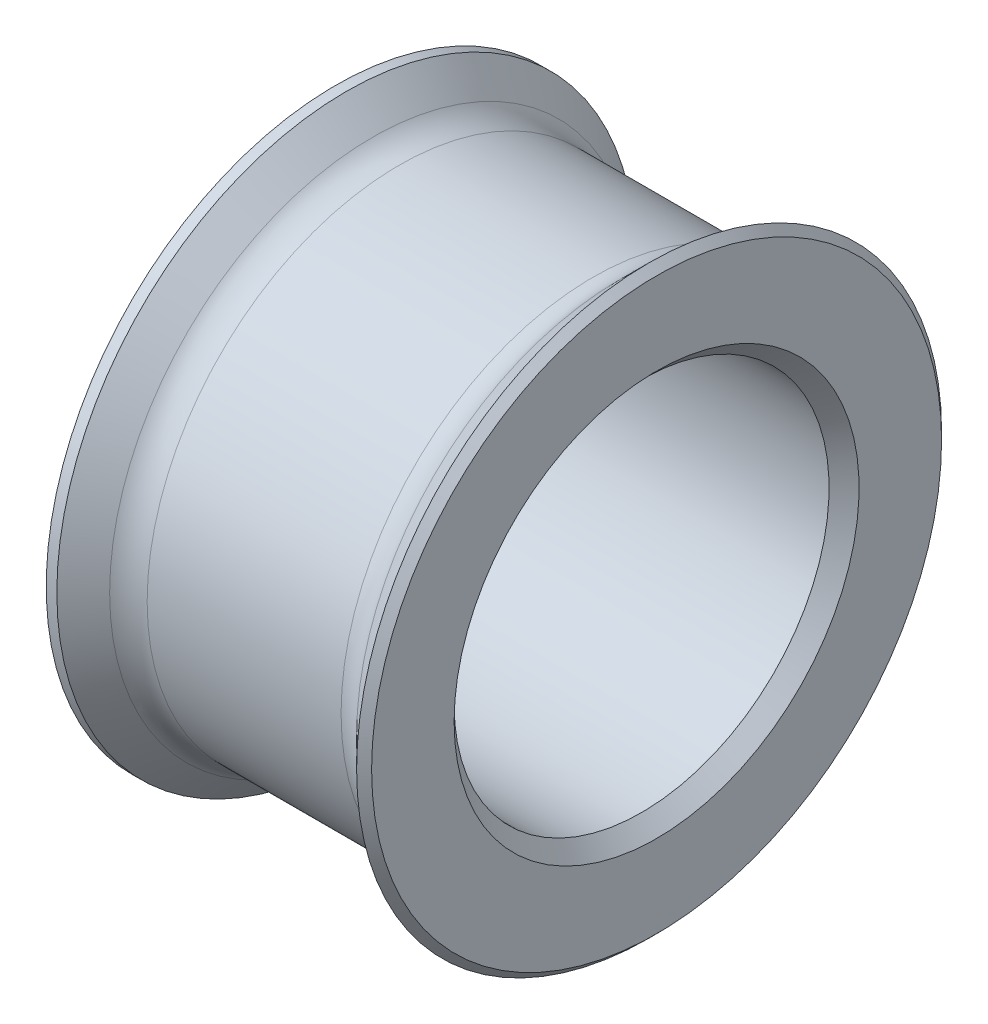
ISO-10303-21;
HEADER;
FILE_DESCRIPTION(('STEP AP214'),'2;1');
FILE_NAME('part.step','',(''),(''),'','','');
FILE_SCHEMA(('AUTOMOTIVE_DESIGN { 1 0 10303 214 1 1 1 1 }'));
ENDSEC;
DATA;
#1=APPLICATION_CONTEXT('core data for automotive mechanical design processes');
#2=APPLICATION_PROTOCOL_DEFINITION('international standard','automotive_design',2000,#1);
#3=PRODUCT_CONTEXT('',#1,'mechanical');
#4=PRODUCT('Part','Part','',(#3));
#5=PRODUCT_RELATED_PRODUCT_CATEGORY('part','',(#4));
#6=PRODUCT_DEFINITION_FORMATION('','',#4);
#7=PRODUCT_DEFINITION_CONTEXT('part definition',#1,'design');
#8=PRODUCT_DEFINITION('design','',#6,#7);
#9=PRODUCT_DEFINITION_SHAPE('','',#8);
#10=(LENGTH_UNIT() NAMED_UNIT(*) SI_UNIT(.MILLI.,.METRE.));
#11=(NAMED_UNIT(*) PLANE_ANGLE_UNIT() SI_UNIT($,.RADIAN.));
#12=(NAMED_UNIT(*) SI_UNIT($,.STERADIAN.) SOLID_ANGLE_UNIT());
#13=UNCERTAINTY_MEASURE_WITH_UNIT(LENGTH_MEASURE(1.E-05),#10,'distance_accuracy_value','');
#14=(GEOMETRIC_REPRESENTATION_CONTEXT(3) GLOBAL_UNCERTAINTY_ASSIGNED_CONTEXT((#13)) GLOBAL_UNIT_ASSIGNED_CONTEXT((#10,
#11,#12)) REPRESENTATION_CONTEXT('',''));
#15=CARTESIAN_POINT('',(0.,0.,0.));
#16=DIRECTION('',(0.,0.,1.));
#17=DIRECTION('',(1.,0.,0.));
#18=AXIS2_PLACEMENT_3D('',#15,#16,#17);
#19=CARTESIAN_POINT('',(0.,0.,0.));
#20=DIRECTION('',(-1.,0.,0.));
#21=DIRECTION('',(0.,0.,1.));
#22=AXIS2_PLACEMENT_3D('',#19,#20,#21);
#23=CYLINDRICAL_SURFACE('',#22,3.36);
#24=CARTESIAN_POINT('',(1.29289321881345,0.,0.));
#25=DIRECTION('',(-1.,0.,0.));
#26=DIRECTION('',(0.,0.,1.));
#27=AXIS2_PLACEMENT_3D('',#24,#25,#26);
#28=CIRCLE('',#27,3.36);
#29=CARTESIAN_POINT('',(1.29289321881345,0.,3.36));
#30=VERTEX_POINT('',#29);
#31=EDGE_CURVE('E44',#30,#30,#28,.T.);
#32=ORIENTED_EDGE('',*,*,#31,.T.);
#33=EDGE_LOOP('',(#32));
#34=FACE_BOUND('',#33,.T.);
#35=CARTESIAN_POINT('',(-1.29289321881345,0.,0.));
#36=DIRECTION('',(-1.,0.,0.));
#37=DIRECTION('',(0.,0.,1.));
#38=AXIS2_PLACEMENT_3D('',#35,#36,#37);
#39=CIRCLE('',#38,3.36);
#40=CARTESIAN_POINT('',(-1.29289321881345,0.,3.36));
#41=VERTEX_POINT('',#40);
#42=EDGE_CURVE('E48',#41,#41,#39,.F.);
#43=ORIENTED_EDGE('',*,*,#42,.T.);
#44=EDGE_LOOP('',(#43));
#45=FACE_BOUND('',#44,.T.);
#46=ADVANCED_FACE('F33',(#34,#45),#23,.T.);
#47=CARTESIAN_POINT('',(2.14,0.,0.));
#48=DIRECTION('',(1.,0.,0.));
#49=DIRECTION('',(0.,0.,-1.));
#50=AXIS2_PLACEMENT_3D('',#47,#48,#49);
#51=CONICAL_SURFACE('',#50,4.,0.78539816339745);
#52=CARTESIAN_POINT('',(1.64644660940673,0.,0.));
#53=DIRECTION('',(1.,0.,0.));
#54=DIRECTION('',(0.,0.,-1.));
#55=AXIS2_PLACEMENT_3D('',#52,#53,#54);
#56=CIRCLE('',#55,3.50644660940673);
#57=CARTESIAN_POINT('',(1.64644660940673,0.,-3.50644660940673));
#58=VERTEX_POINT('',#57);
#59=EDGE_CURVE('E40',#58,#58,#56,.T.);
#60=ORIENTED_EDGE('',*,*,#59,.T.);
#61=EDGE_LOOP('',(#60));
#62=FACE_BOUND('',#61,.T.);
#63=CARTESIAN_POINT('',(2.03999999999999,0.,0.));
#64=DIRECTION('',(-1.,0.,0.));
#65=DIRECTION('',(0.,0.,1.));
#66=AXIS2_PLACEMENT_3D('',#63,#64,#65);
#67=CIRCLE('',#66,3.9);
#68=CARTESIAN_POINT('',(2.03999999999999,0.,3.9));
#69=VERTEX_POINT('',#68);
#70=EDGE_CURVE('E53',#69,#69,#67,.T.);
#71=ORIENTED_EDGE('',*,*,#70,.T.);
#72=EDGE_LOOP('',(#71));
#73=FACE_BOUND('',#72,.T.);
#74=ADVANCED_FACE('F103',(#62,#73),#51,.T.);
#75=CARTESIAN_POINT('',(2.14,4.,0.));
#76=DIRECTION('',(-1.,0.,0.));
#77=DIRECTION('',(0.,0.,1.));
#78=AXIS2_PLACEMENT_3D('',#75,#76,#77);
#79=PLANE('',#78);
#80=CARTESIAN_POINT('',(2.14,0.,0.));
#81=DIRECTION('',(-1.,0.,0.));
#82=DIRECTION('',(0.,0.,1.));
#83=AXIS2_PLACEMENT_3D('',#80,#81,#82);
#84=CIRCLE('',#83,2.7);
#85=CARTESIAN_POINT('',(2.14,0.,2.7));
#86=VERTEX_POINT('',#85);
#87=EDGE_CURVE('E56',#86,#86,#84,.T.);
#88=ORIENTED_EDGE('',*,*,#87,.T.);
#89=EDGE_LOOP('',(#88));
#90=FACE_BOUND('',#89,.T.);
#91=CARTESIAN_POINT('',(2.14,0.,0.));
#92=DIRECTION('',(-1.,0.,0.));
#93=DIRECTION('',(0.,0.,1.));
#94=AXIS2_PLACEMENT_3D('',#91,#92,#93);
#95=CIRCLE('',#94,3.8);
#96=CARTESIAN_POINT('',(2.14,0.,3.8));
#97=VERTEX_POINT('',#96);
#98=EDGE_CURVE('E59',#97,#97,#95,.F.);
#99=ORIENTED_EDGE('',*,*,#98,.T.);
#100=EDGE_LOOP('',(#99));
#101=FACE_BOUND('',#100,.T.);
#102=ADVANCED_FACE('F91',(#90,#101),#79,.F.);
#103=CARTESIAN_POINT('',(0.,0.,0.));
#104=DIRECTION('',(-1.,0.,0.));
#105=DIRECTION('',(0.,0.,1.));
#106=AXIS2_PLACEMENT_3D('',#103,#104,#105);
#107=CYLINDRICAL_SURFACE('',#106,2.5);
#108=CARTESIAN_POINT('',(-1.93999999999999,0.,0.));
#109=DIRECTION('',(1.,0.,0.));
#110=DIRECTION('',(0.,0.,-1.));
#111=AXIS2_PLACEMENT_3D('',#108,#109,#110);
#112=CIRCLE('',#111,2.5);
#113=CARTESIAN_POINT('',(-1.93999999999999,0.,2.5));
#114=VERTEX_POINT('',#113);
#115=EDGE_CURVE('E62',#114,#114,#112,.F.);
#116=ORIENTED_EDGE('',*,*,#115,.T.);
#117=EDGE_LOOP('',(#116));
#118=FACE_BOUND('',#117,.T.);
#119=CARTESIAN_POINT('',(1.94,0.,0.));
#120=DIRECTION('',(-1.,0.,0.));
#121=DIRECTION('',(0.,0.,1.));
#122=AXIS2_PLACEMENT_3D('',#119,#120,#121);
#123=CIRCLE('',#122,2.5);
#124=CARTESIAN_POINT('',(1.94,0.,2.5));
#125=VERTEX_POINT('',#124);
#126=EDGE_CURVE('E65',#125,#125,#123,.F.);
#127=ORIENTED_EDGE('',*,*,#126,.T.);
#128=EDGE_LOOP('',(#127));
#129=FACE_BOUND('',#128,.T.);
#130=ADVANCED_FACE('F88',(#118,#129),#107,.F.);
#131=CARTESIAN_POINT('',(-2.14,2.5,0.));
#132=DIRECTION('',(1.,0.,0.));
#133=DIRECTION('',(0.,0.,-1.));
#134=AXIS2_PLACEMENT_3D('',#131,#132,#133);
#135=PLANE('',#134);
#136=CARTESIAN_POINT('',(-2.14,0.,0.));
#137=DIRECTION('',(1.,0.,0.));
#138=DIRECTION('',(0.,0.,-1.));
#139=AXIS2_PLACEMENT_3D('',#136,#137,#138);
#140=CIRCLE('',#139,3.85857864376269);
#141=CARTESIAN_POINT('',(-2.14,0.,-3.85857864376269));
#142=VERTEX_POINT('',#141);
#143=EDGE_CURVE('E71',#142,#142,#140,.F.);
#144=ORIENTED_EDGE('',*,*,#143,.T.);
#145=EDGE_LOOP('',(#144));
#146=FACE_BOUND('',#145,.T.);
#147=CARTESIAN_POINT('',(-2.14,0.,0.));
#148=DIRECTION('',(1.,0.,0.));
#149=DIRECTION('',(0.,0.,-1.));
#150=AXIS2_PLACEMENT_3D('',#147,#148,#149);
#151=CIRCLE('',#150,2.70000000000001);
#152=CARTESIAN_POINT('',(-2.14,0.,2.70000000000001));
#153=VERTEX_POINT('',#152);
#154=EDGE_CURVE('E74',#153,#153,#151,.T.);
#155=ORIENTED_EDGE('',*,*,#154,.T.);
#156=EDGE_LOOP('',(#155));
#157=FACE_BOUND('',#156,.T.);
#158=ADVANCED_FACE('F78',(#146,#157),#135,.F.);
#159=CARTESIAN_POINT('',(-1.5,0.,0.));
#160=DIRECTION('',(-1.,0.,0.));
#161=DIRECTION('',(0.,0.,1.));
#162=AXIS2_PLACEMENT_3D('',#159,#160,#161);
#163=CONICAL_SURFACE('',#162,3.36,0.78539816339745);
#164=CARTESIAN_POINT('',(-1.64644660940673,0.,0.));
#165=DIRECTION('',(-1.,0.,0.));
#166=DIRECTION('',(0.,0.,1.));
#167=AXIS2_PLACEMENT_3D('',#164,#165,#166);
#168=CIRCLE('',#167,3.50644660940673);
#169=CARTESIAN_POINT('',(-1.64644660940673,0.,3.50644660940673));
#170=VERTEX_POINT('',#169);
#171=EDGE_CURVE('E10',#170,#170,#168,.T.);
#172=ORIENTED_EDGE('',*,*,#171,.T.);
#173=EDGE_LOOP('',(#172));
#174=FACE_BOUND('',#173,.T.);
#175=CARTESIAN_POINT('',(-1.99857864376269,0.,0.));
#176=DIRECTION('',(1.,0.,0.));
#177=DIRECTION('',(0.,0.,-1.));
#178=AXIS2_PLACEMENT_3D('',#175,#176,#177);
#179=CIRCLE('',#178,3.85857864376269);
#180=CARTESIAN_POINT('',(-1.99857864376269,0.,-3.85857864376269));
#181=VERTEX_POINT('',#180);
#182=EDGE_CURVE('E68',#181,#181,#179,.T.);
#183=ORIENTED_EDGE('',*,*,#182,.T.);
#184=EDGE_LOOP('',(#183));
#185=FACE_BOUND('',#184,.T.);
#186=ADVANCED_FACE('F126',(#174,#185),#163,.T.);
#187=CARTESIAN_POINT('',(-2.14,0.,0.));
#188=DIRECTION('',(1.,0.,0.));
#189=DIRECTION('',(0.,0.,-1.));
#190=AXIS2_PLACEMENT_3D('',#187,#188,#189);
#191=CYLINDRICAL_SURFACE('',#190,3.85857864376269);
#192=ORIENTED_EDGE('',*,*,#182,.F.);
#193=EDGE_LOOP('',(#192));
#194=FACE_BOUND('',#193,.T.);
#195=ORIENTED_EDGE('',*,*,#143,.F.);
#196=EDGE_LOOP('',(#195));
#197=FACE_BOUND('',#196,.T.);
#198=ADVANCED_FACE('F84',(#194,#197),#191,.T.);
#199=CARTESIAN_POINT('',(-1.93999999999999,0.,0.));
#200=DIRECTION('',(-1.,0.,0.));
#201=DIRECTION('',(0.,0.,1.));
#202=AXIS2_PLACEMENT_3D('',#199,#200,#201);
#203=CONICAL_SURFACE('',#202,2.5,0.785398163397449);
#204=CARTESIAN_POINT('',(-2.14,0.,2.70000000000001));
#205=CARTESIAN_POINT('',(-2.13791666666666,0.,2.69791666666667));
#206=CARTESIAN_POINT('',(-2.13583333333333,0.,2.69583333333334));
#207=CARTESIAN_POINT('',(-2.13166666666666,0.,2.69166666666667));
#208=CARTESIAN_POINT('',(-2.12958333333333,0.,2.68958333333334));
#209=CARTESIAN_POINT('',(-2.12541666666666,0.,2.68541666666667));
#210=CARTESIAN_POINT('',(-2.12333333333333,0.,2.68333333333334));
#211=CARTESIAN_POINT('',(-2.11916666666666,0.,2.67916666666667));
#212=CARTESIAN_POINT('',(-2.11708333333333,0.,2.67708333333334));
#213=CARTESIAN_POINT('',(-2.11291666666666,0.,2.67291666666667));
#214=CARTESIAN_POINT('',(-2.11083333333333,0.,2.67083333333334));
#215=CARTESIAN_POINT('',(-2.10666666666666,0.,2.66666666666667));
#216=CARTESIAN_POINT('',(-2.10458333333333,0.,2.66458333333334));
#217=CARTESIAN_POINT('',(-2.10041666666666,0.,2.66041666666667));
#218=CARTESIAN_POINT('',(-2.09833333333333,0.,2.65833333333334));
#219=CARTESIAN_POINT('',(-2.09416666666666,0.,2.65416666666667));
#220=CARTESIAN_POINT('',(-2.09208333333333,0.,2.65208333333334));
#221=CARTESIAN_POINT('',(-2.08791666666666,0.,2.64791666666667));
#222=CARTESIAN_POINT('',(-2.08583333333333,0.,2.64583333333334));
#223=CARTESIAN_POINT('',(-2.08166666666666,0.,2.64166666666667));
#224=CARTESIAN_POINT('',(-2.07958333333333,0.,2.63958333333334));
#225=CARTESIAN_POINT('',(-2.07541666666666,0.,2.63541666666667));
#226=CARTESIAN_POINT('',(-2.07333333333333,0.,2.63333333333334));
#227=CARTESIAN_POINT('',(-2.06916666666666,0.,2.62916666666667));
#228=CARTESIAN_POINT('',(-2.06708333333333,0.,2.62708333333334));
#229=CARTESIAN_POINT('',(-2.06291666666666,0.,2.62291666666667));
#230=CARTESIAN_POINT('',(-2.06083333333333,0.,2.62083333333334));
#231=CARTESIAN_POINT('',(-2.05666666666666,0.,2.61666666666667));
#232=CARTESIAN_POINT('',(-2.05458333333333,0.,2.61458333333334));
#233=CARTESIAN_POINT('',(-2.05041666666666,0.,2.61041666666667));
#234=CARTESIAN_POINT('',(-2.04833333333333,0.,2.60833333333334));
#235=CARTESIAN_POINT('',(-2.04416666666666,0.,2.60416666666667));
#236=CARTESIAN_POINT('',(-2.04208333333333,0.,2.60208333333334));
#237=CARTESIAN_POINT('',(-2.03791666666666,0.,2.59791666666667));
#238=CARTESIAN_POINT('',(-2.03583333333333,0.,2.59583333333334));
#239=CARTESIAN_POINT('',(-2.03166666666666,0.,2.59166666666667));
#240=CARTESIAN_POINT('',(-2.02958333333333,0.,2.58958333333334));
#241=CARTESIAN_POINT('',(-2.02541666666666,0.,2.58541666666667));
#242=CARTESIAN_POINT('',(-2.02333333333333,0.,2.58333333333334));
#243=CARTESIAN_POINT('',(-2.01916666666666,0.,2.57916666666667));
#244=CARTESIAN_POINT('',(-2.01708333333333,0.,2.57708333333334));
#245=CARTESIAN_POINT('',(-2.01291666666666,0.,2.57291666666667));
#246=CARTESIAN_POINT('',(-2.01083333333333,0.,2.57083333333334));
#247=CARTESIAN_POINT('',(-2.00666666666666,0.,2.56666666666667));
#248=CARTESIAN_POINT('',(-2.00458333333333,0.,2.56458333333334));
#249=CARTESIAN_POINT('',(-2.00041666666666,0.,2.56041666666667));
#250=CARTESIAN_POINT('',(-1.99833333333333,0.,2.55833333333334));
#251=CARTESIAN_POINT('',(-1.99416666666666,0.,2.55416666666667));
#252=CARTESIAN_POINT('',(-1.99208333333333,0.,2.55208333333334));
#253=CARTESIAN_POINT('',(-1.98791666666666,0.,2.54791666666667));
#254=CARTESIAN_POINT('',(-1.98583333333333,0.,2.54583333333334));
#255=CARTESIAN_POINT('',(-1.98166666666666,0.,2.54166666666667));
#256=CARTESIAN_POINT('',(-1.97958333333333,0.,2.53958333333334));
#257=CARTESIAN_POINT('',(-1.97541666666666,0.,2.53541666666667));
#258=CARTESIAN_POINT('',(-1.97333333333333,0.,2.53333333333333));
#259=CARTESIAN_POINT('',(-1.96916666666666,0.,2.52916666666667));
#260=CARTESIAN_POINT('',(-1.96708333333333,0.,2.52708333333333));
#261=CARTESIAN_POINT('',(-1.96291666666666,0.,2.52291666666667));
#262=CARTESIAN_POINT('',(-1.96083333333333,0.,2.52083333333333));
#263=CARTESIAN_POINT('',(-1.95666666666666,0.,2.51666666666667));
#264=CARTESIAN_POINT('',(-1.95458333333333,0.,2.51458333333333));
#265=CARTESIAN_POINT('',(-1.95041666666666,0.,2.51041666666667));
#266=CARTESIAN_POINT('',(-1.94833333333333,0.,2.50833333333333));
#267=CARTESIAN_POINT('',(-1.94416666666666,0.,2.50416666666667));
#268=CARTESIAN_POINT('',(-1.94208333333333,0.,2.50208333333333));
#269=CARTESIAN_POINT('',(-1.93999999999999,0.,2.5));
#270=B_SPLINE_CURVE_WITH_KNOTS('',3,(#204,#205,#206,#207,#208,#209,#210,#211,#212,#213,#214,
#215,#216,#217,#218,#219,#220,#221,#222,#223,#224,#225,#226,#227,#228,#229,#230,#231,#232,#233,
#234,#235,#236,#237,#238,#239,#240,#241,#242,#243,#244,#245,#246,#247,#248,#249,#250,#251,#252,
#253,#254,#255,#256,#257,#258,#259,#260,#261,#262,#263,#264,#265,#266,#267,#268,#269),
.UNSPECIFIED.,.F.,.F.,(4,2,2,2,2,2,2,2,2,2,2,2,2,2,2,2,2,2,2,2,2,2,2,2,2,2,2,2,2,2,2,2,4),(0.,
0.0088388347648321,0.0176776695296642,0.0265165042944963,0.0353553390593284,0.0441941738241605,
0.0530330085889926,0.0618718433538247,0.0707106781186571,0.0795495128834889,0.0883883476483213,
0.0972271824131531,0.106066017177985,0.114904851942818,0.12374368670765,0.132582521472482,
0.141421356237314,0.150260191002146,0.159099025766978,0.16793786053181,0.176776695296642,
0.185615530061474,0.194454364826306,0.203293199591139,0.212132034355971,0.220970869120803,
0.229809703885635,0.238648538650467,0.247487373415299,0.256326208180131,0.265165042944963,
0.274003877709795,0.282842712474627),.UNSPECIFIED.);
#271=EDGE_CURVE('BSEAM80',#153,#114,#270,.T.);
#272=ORIENTED_EDGE('',*,*,#154,.F.);
#273=ORIENTED_EDGE('',*,*,#115,.F.);
#274=ORIENTED_EDGE('',*,*,#271,.T.);
#275=ORIENTED_EDGE('',*,*,#271,.F.);
#276=EDGE_LOOP('',(#272,#274,#273,#275));
#277=FACE_BOUND('',#276,.T.);
#278=ADVANCED_FACE('F80',(#277),#203,.F.);
#279=CARTESIAN_POINT('',(2.14,0.,0.));
#280=DIRECTION('',(1.,0.,0.));
#281=DIRECTION('',(0.,0.,-1.));
#282=AXIS2_PLACEMENT_3D('',#279,#280,#281);
#283=CONICAL_SURFACE('',#282,2.7,0.785398163397445);
#284=ORIENTED_EDGE('',*,*,#126,.F.);
#285=EDGE_LOOP('',(#284));
#286=FACE_BOUND('',#285,.T.);
#287=ORIENTED_EDGE('',*,*,#87,.F.);
#288=EDGE_LOOP('',(#287));
#289=FACE_BOUND('',#288,.T.);
#290=ADVANCED_FACE('F83',(#286,#289),#283,.F.);
#291=CARTESIAN_POINT('',(2.03999999999999,0.,0.));
#292=DIRECTION('',(-1.,0.,0.));
#293=DIRECTION('',(0.,0.,1.));
#294=AXIS2_PLACEMENT_3D('',#291,#292,#293);
#295=CONICAL_SURFACE('',#294,3.9,0.785398163397438);
#296=ORIENTED_EDGE('',*,*,#98,.F.);
#297=EDGE_LOOP('',(#296));
#298=FACE_BOUND('',#297,.T.);
#299=ORIENTED_EDGE('',*,*,#70,.F.);
#300=EDGE_LOOP('',(#299));
#301=FACE_BOUND('',#300,.T.);
#302=ADVANCED_FACE('F97',(#298,#301),#295,.T.);
#303=CARTESIAN_POINT('',(1.29289321881345,0.,0.));
#304=DIRECTION('',(-1.,0.,0.));
#305=DIRECTION('',(0.,0.,1.));
#306=AXIS2_PLACEMENT_3D('',#303,#304,#305);
#307=TOROIDAL_SURFACE('',#306,3.86,0.5);
#308=ORIENTED_EDGE('',*,*,#59,.F.);
#309=EDGE_LOOP('',(#308));
#310=FACE_BOUND('',#309,.T.);
#311=ORIENTED_EDGE('',*,*,#31,.F.);
#312=EDGE_LOOP('',(#311));
#313=FACE_BOUND('',#312,.T.);
#314=ADVANCED_FACE('F109',(#310,#313),#307,.F.);
#315=CARTESIAN_POINT('',(-1.29289321881345,0.,0.));
#316=DIRECTION('',(-1.,0.,0.));
#317=DIRECTION('',(0.,0.,1.));
#318=AXIS2_PLACEMENT_3D('',#315,#316,#317);
#319=TOROIDAL_SURFACE('',#318,3.86,0.5);
#320=ORIENTED_EDGE('',*,*,#42,.F.);
#321=EDGE_LOOP('',(#320));
#322=FACE_BOUND('',#321,.T.);
#323=ORIENTED_EDGE('',*,*,#171,.F.);
#324=EDGE_LOOP('',(#323));
#325=FACE_BOUND('',#324,.T.);
#326=ADVANCED_FACE('F35',(#322,#325),#319,.F.);
#327=CLOSED_SHELL('',(#46,#74,#102,#130,#158,#186,#198,#278,#290,#302,#314,#326));
#328=MANIFOLD_SOLID_BREP('B2',#327);
#329=ADVANCED_BREP_SHAPE_REPRESENTATION('',(#18,#328),#14);
#330=SHAPE_DEFINITION_REPRESENTATION(#9,#329);
ENDSEC;
END-ISO-10303-21;
